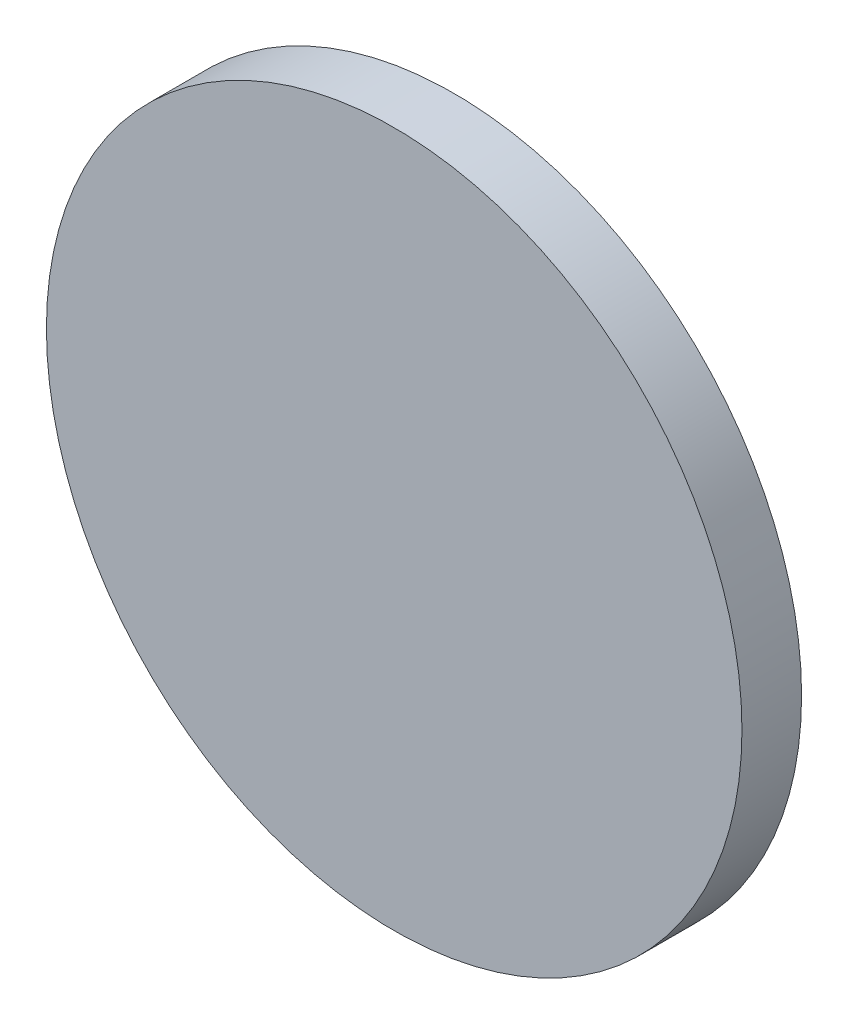
ISO-10303-21;
HEADER;
FILE_DESCRIPTION(('STEP AP214'),'2;1');
FILE_NAME('part.step','',(''),(''),'','','');
FILE_SCHEMA(('AUTOMOTIVE_DESIGN { 1 0 10303 214 1 1 1 1 }'));
ENDSEC;
DATA;
#1=APPLICATION_CONTEXT('core data for automotive mechanical design processes');
#2=APPLICATION_PROTOCOL_DEFINITION('international standard','automotive_design',2000,#1);
#3=PRODUCT_CONTEXT('',#1,'mechanical');
#4=PRODUCT('Part','Part','',(#3));
#5=PRODUCT_RELATED_PRODUCT_CATEGORY('part','',(#4));
#6=PRODUCT_DEFINITION_FORMATION('','',#4);
#7=PRODUCT_DEFINITION_CONTEXT('part definition',#1,'design');
#8=PRODUCT_DEFINITION('design','',#6,#7);
#9=PRODUCT_DEFINITION_SHAPE('','',#8);
#10=(LENGTH_UNIT() NAMED_UNIT(*) SI_UNIT(.MILLI.,.METRE.));
#11=(NAMED_UNIT(*) PLANE_ANGLE_UNIT() SI_UNIT($,.RADIAN.));
#12=(NAMED_UNIT(*) SI_UNIT($,.STERADIAN.) SOLID_ANGLE_UNIT());
#13=UNCERTAINTY_MEASURE_WITH_UNIT(LENGTH_MEASURE(1.E-05),#10,'distance_accuracy_value','');
#14=(GEOMETRIC_REPRESENTATION_CONTEXT(3) GLOBAL_UNCERTAINTY_ASSIGNED_CONTEXT((#13)) GLOBAL_UNIT_ASSIGNED_CONTEXT((#10,
#11,#12)) REPRESENTATION_CONTEXT('',''));
#15=CARTESIAN_POINT('',(0.,0.,0.));
#16=DIRECTION('',(0.,0.,1.));
#17=DIRECTION('',(1.,0.,0.));
#18=AXIS2_PLACEMENT_3D('',#15,#16,#17);
#19=CARTESIAN_POINT('',(8.42518,1.648460006176,0.));
#20=DIRECTION('',(0.,0.,-1.));
#21=DIRECTION('',(-1.,0.,0.));
#22=AXIS2_PLACEMENT_3D('',#19,#20,#21);
#23=PLANE('',#22);
#24=CARTESIAN_POINT('',(8.42518,1.648460006176,0.));
#25=DIRECTION('',(0.,0.,1.));
#26=DIRECTION('',(1.,0.,0.));
#27=AXIS2_PLACEMENT_3D('',#24,#25,#26);
#28=CIRCLE('',#27,0.200024667);
#29=CARTESIAN_POINT('',(8.625204667,1.648460006176,0.));
#30=VERTEX_POINT('',#29);
#31=EDGE_CURVE('E18',#30,#30,#28,.T.);
#32=ORIENTED_EDGE('',*,*,#31,.F.);
#33=EDGE_LOOP('',(#32));
#34=FACE_BOUND('',#33,.T.);
#35=ADVANCED_FACE('F15',(#34),#23,.T.);
#36=CARTESIAN_POINT('',(8.42518,1.648460006176,0.));
#37=DIRECTION('',(0.,0.,1.));
#38=DIRECTION('',(1.,0.,0.));
#39=AXIS2_PLACEMENT_3D('',#36,#37,#38);
#40=CYLINDRICAL_SURFACE('',#39,0.200024667);
#41=CARTESIAN_POINT('',(8.42518,1.648460006176,0.03429));
#42=DIRECTION('',(0.,0.,1.));
#43=DIRECTION('',(1.,0.,0.));
#44=AXIS2_PLACEMENT_3D('',#41,#42,#43);
#45=CIRCLE('',#44,0.200024667);
#46=CARTESIAN_POINT('',(8.625204667,1.648460006176,0.03429));
#47=VERTEX_POINT('',#46);
#48=EDGE_CURVE('E10',#47,#47,#45,.T.);
#49=ORIENTED_EDGE('',*,*,#48,.F.);
#50=EDGE_LOOP('',(#49));
#51=FACE_BOUND('',#50,.T.);
#52=ORIENTED_EDGE('',*,*,#31,.T.);
#53=EDGE_LOOP('',(#52));
#54=FACE_BOUND('',#53,.T.);
#55=ADVANCED_FACE('F27',(#51,#54),#40,.T.);
#56=CARTESIAN_POINT('',(8.42518,1.648460006176,0.03429));
#57=DIRECTION('',(0.,0.,1.));
#58=DIRECTION('',(1.,0.,0.));
#59=AXIS2_PLACEMENT_3D('',#56,#57,#58);
#60=PLANE('',#59);
#61=ORIENTED_EDGE('',*,*,#48,.T.);
#62=EDGE_LOOP('',(#61));
#63=FACE_BOUND('',#62,.T.);
#64=ADVANCED_FACE('F34',(#63),#60,.T.);
#65=CLOSED_SHELL('',(#35,#55,#64));
#66=MANIFOLD_SOLID_BREP('B1',#65);
#67=ADVANCED_BREP_SHAPE_REPRESENTATION('',(#18,#66),#14);
#68=SHAPE_DEFINITION_REPRESENTATION(#9,#67);
ENDSEC;
END-ISO-10303-21;
